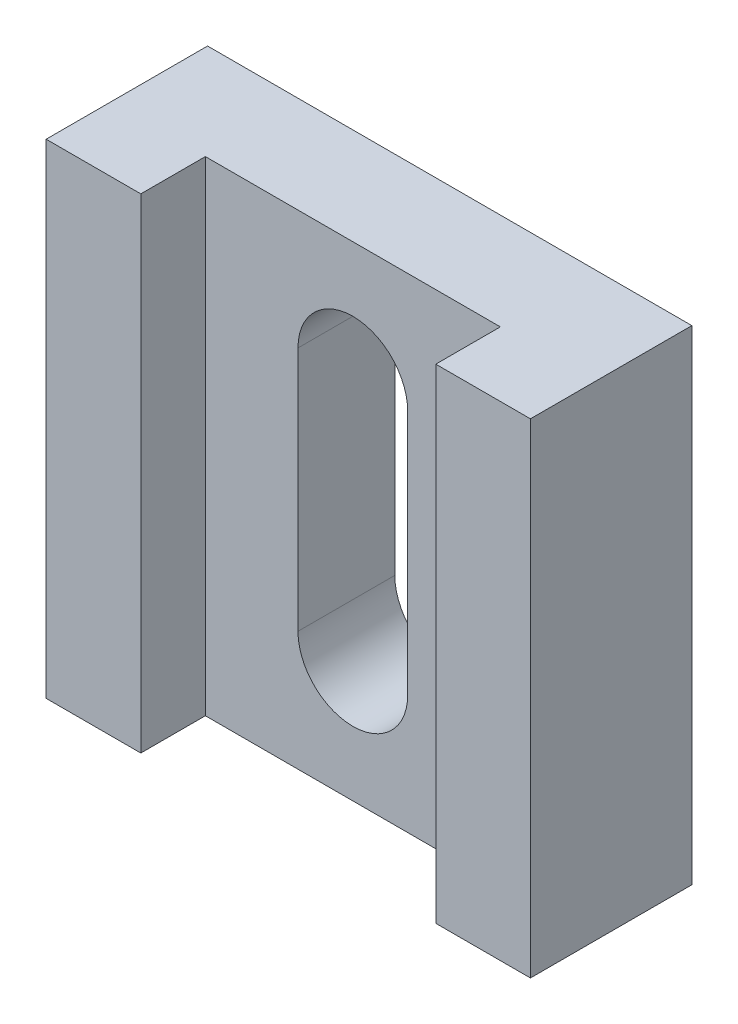
ISO-10303-21;
HEADER;
FILE_DESCRIPTION(('STEP AP214'),'2;1');
FILE_NAME('part.step','',(''),(''),'','','');
FILE_SCHEMA(('AUTOMOTIVE_DESIGN { 1 0 10303 214 1 1 1 1 }'));
ENDSEC;
DATA;
#1=APPLICATION_CONTEXT('core data for automotive mechanical design processes');
#2=APPLICATION_PROTOCOL_DEFINITION('international standard','automotive_design',2000,#1);
#3=PRODUCT_CONTEXT('',#1,'mechanical');
#4=PRODUCT('Part','Part','',(#3));
#5=PRODUCT_RELATED_PRODUCT_CATEGORY('part','',(#4));
#6=PRODUCT_DEFINITION_FORMATION('','',#4);
#7=PRODUCT_DEFINITION_CONTEXT('part definition',#1,'design');
#8=PRODUCT_DEFINITION('design','',#6,#7);
#9=PRODUCT_DEFINITION_SHAPE('','',#8);
#10=(LENGTH_UNIT() NAMED_UNIT(*) SI_UNIT(.MILLI.,.METRE.));
#11=(NAMED_UNIT(*) PLANE_ANGLE_UNIT() SI_UNIT($,.RADIAN.));
#12=(NAMED_UNIT(*) SI_UNIT($,.STERADIAN.) SOLID_ANGLE_UNIT());
#13=UNCERTAINTY_MEASURE_WITH_UNIT(LENGTH_MEASURE(1.E-05),#10,'distance_accuracy_value','');
#14=(GEOMETRIC_REPRESENTATION_CONTEXT(3) GLOBAL_UNCERTAINTY_ASSIGNED_CONTEXT((#13)) GLOBAL_UNIT_ASSIGNED_CONTEXT((#10,
#11,#12)) REPRESENTATION_CONTEXT('',''));
#15=CARTESIAN_POINT('',(0.,0.,0.));
#16=DIRECTION('',(0.,0.,1.));
#17=DIRECTION('',(1.,0.,0.));
#18=AXIS2_PLACEMENT_3D('',#15,#16,#17);
#19=CARTESIAN_POINT('',(0.,0.,5.));
#20=DIRECTION('',(0.,0.,1.));
#21=DIRECTION('',(1.,0.,0.));
#22=AXIS2_PLACEMENT_3D('',#19,#20,#21);
#23=PLANE('',#22);
#24=DIRECTION('',(0.,1.,0.));
#25=VECTOR('',#24,1.);
#26=CARTESIAN_POINT('',(4.56808059733739,7.5,5.));
#27=LINE('',#26,#25);
#28=CARTESIAN_POINT('',(4.56808059733739,-7.5,5.));
#29=VERTEX_POINT('',#28);
#30=CARTESIAN_POINT('',(4.56808059733739,7.5,5.));
#31=VERTEX_POINT('',#30);
#32=EDGE_CURVE('E158',#29,#31,#27,.T.);
#33=ORIENTED_EDGE('',*,*,#32,.F.);
#34=DIRECTION('',(1.,0.,0.));
#35=VECTOR('',#34,1.);
#36=CARTESIAN_POINT('',(-7.5,-7.5,5.));
#37=LINE('',#36,#35);
#38=CARTESIAN_POINT('',(7.5,-7.5,5.));
#39=VERTEX_POINT('',#38);
#40=EDGE_CURVE('E195',#29,#39,#37,.T.);
#41=ORIENTED_EDGE('',*,*,#40,.T.);
#42=DIRECTION('',(0.,1.,0.));
#43=VECTOR('',#42,1.);
#44=CARTESIAN_POINT('',(7.5,7.5,5.));
#45=LINE('',#44,#43);
#46=CARTESIAN_POINT('',(7.5,7.5,5.));
#47=VERTEX_POINT('',#46);
#48=EDGE_CURVE('E185',#39,#47,#45,.T.);
#49=ORIENTED_EDGE('',*,*,#48,.T.);
#50=DIRECTION('',(-1.,0.,0.));
#51=VECTOR('',#50,1.);
#52=CARTESIAN_POINT('',(-7.5,7.5,5.));
#53=LINE('',#52,#51);
#54=EDGE_CURVE('E190',#47,#31,#53,.T.);
#55=ORIENTED_EDGE('',*,*,#54,.T.);
#56=EDGE_LOOP('',(#33,#41,#49,#55));
#57=FACE_BOUND('',#56,.T.);
#58=ADVANCED_FACE('F33',(#57),#23,.T.);
#59=CARTESIAN_POINT('',(7.5,7.5,5.));
#60=DIRECTION('',(-1.,0.,0.));
#61=DIRECTION('',(0.,-1.,0.));
#62=AXIS2_PLACEMENT_3D('',#59,#60,#61);
#63=PLANE('',#62);
#64=DIRECTION('',(0.,1.,0.));
#65=VECTOR('',#64,1.);
#66=CARTESIAN_POINT('',(7.5,7.5,0.));
#67=LINE('',#66,#65);
#68=CARTESIAN_POINT('',(7.5,-7.5,0.));
#69=VERTEX_POINT('',#68);
#70=CARTESIAN_POINT('',(7.5,7.5,0.));
#71=VERTEX_POINT('',#70);
#72=EDGE_CURVE('E177',#69,#71,#67,.T.);
#73=ORIENTED_EDGE('',*,*,#72,.T.);
#74=DIRECTION('',(0.,0.,-1.));
#75=VECTOR('',#74,1.);
#76=CARTESIAN_POINT('',(7.5,7.5,5.));
#77=LINE('',#76,#75);
#78=EDGE_CURVE('E11',#47,#71,#77,.T.);
#79=ORIENTED_EDGE('',*,*,#78,.F.);
#80=ORIENTED_EDGE('',*,*,#48,.F.);
#81=DIRECTION('',(0.,0.,-1.));
#82=VECTOR('',#81,1.);
#83=CARTESIAN_POINT('',(7.5,-7.5,5.));
#84=LINE('',#83,#82);
#85=EDGE_CURVE('E199',#39,#69,#84,.T.);
#86=ORIENTED_EDGE('',*,*,#85,.T.);
#87=EDGE_LOOP('',(#73,#79,#80,#86));
#88=FACE_BOUND('',#87,.T.);
#89=ADVANCED_FACE('F35',(#88),#63,.F.);
#90=CARTESIAN_POINT('',(-7.5,7.5,5.));
#91=DIRECTION('',(0.,-1.,0.));
#92=DIRECTION('',(0.,0.,-1.));
#93=AXIS2_PLACEMENT_3D('',#90,#91,#92);
#94=PLANE('',#93);
#95=DIRECTION('',(-1.,0.,0.));
#96=VECTOR('',#95,1.);
#97=CARTESIAN_POINT('',(-4.56808059733739,7.5,3.));
#98=LINE('',#97,#96);
#99=CARTESIAN_POINT('',(4.56808059733739,7.5,3.));
#100=VERTEX_POINT('',#99);
#101=CARTESIAN_POINT('',(-4.56808059733739,7.5,3.));
#102=VERTEX_POINT('',#101);
#103=EDGE_CURVE('E162',#100,#102,#98,.T.);
#104=ORIENTED_EDGE('',*,*,#103,.F.);
#105=DIRECTION('',(0.,0.,1.));
#106=VECTOR('',#105,1.);
#107=CARTESIAN_POINT('',(4.56808059733739,7.5,3.));
#108=LINE('',#107,#106);
#109=EDGE_CURVE('E172',#100,#31,#108,.T.);
#110=ORIENTED_EDGE('',*,*,#109,.T.);
#111=ORIENTED_EDGE('',*,*,#54,.F.);
#112=ORIENTED_EDGE('',*,*,#78,.T.);
#113=DIRECTION('',(-1.,0.,0.));
#114=VECTOR('',#113,1.);
#115=CARTESIAN_POINT('',(-7.5,7.5,0.));
#116=LINE('',#115,#114);
#117=CARTESIAN_POINT('',(-7.5,7.5,0.));
#118=VERTEX_POINT('',#117);
#119=EDGE_CURVE('E202',#71,#118,#116,.T.);
#120=ORIENTED_EDGE('',*,*,#119,.T.);
#121=DIRECTION('',(0.,0.,-1.));
#122=VECTOR('',#121,1.);
#123=CARTESIAN_POINT('',(-7.5,7.5,5.));
#124=LINE('',#123,#122);
#125=CARTESIAN_POINT('',(-7.5,7.5,5.));
#126=VERTEX_POINT('',#125);
#127=EDGE_CURVE('E41',#126,#118,#124,.T.);
#128=ORIENTED_EDGE('',*,*,#127,.F.);
#129=CARTESIAN_POINT('',(-4.56808059733739,7.5,5.));
#130=VERTEX_POINT('',#129);
#131=EDGE_CURVE('E188',#130,#126,#53,.T.);
#132=ORIENTED_EDGE('',*,*,#131,.F.);
#133=DIRECTION('',(0.,0.,1.));
#134=VECTOR('',#133,1.);
#135=CARTESIAN_POINT('',(-4.56808059733739,7.5,3.));
#136=LINE('',#135,#134);
#137=EDGE_CURVE('E181',#102,#130,#136,.T.);
#138=ORIENTED_EDGE('',*,*,#137,.F.);
#139=EDGE_LOOP('',(#104,#110,#111,#112,#120,#128,#132,#138));
#140=FACE_BOUND('',#139,.T.);
#141=ADVANCED_FACE('F245',(#140),#94,.F.);
#142=CARTESIAN_POINT('',(-7.5,7.5,5.));
#143=DIRECTION('',(1.,0.,0.));
#144=DIRECTION('',(0.,1.,0.));
#145=AXIS2_PLACEMENT_3D('',#142,#143,#144);
#146=PLANE('',#145);
#147=DIRECTION('',(0.,-1.,0.));
#148=VECTOR('',#147,1.);
#149=CARTESIAN_POINT('',(-7.5,7.5,0.));
#150=LINE('',#149,#148);
#151=CARTESIAN_POINT('',(-7.5,-7.5,0.));
#152=VERTEX_POINT('',#151);
#153=EDGE_CURVE('E204',#118,#152,#150,.T.);
#154=ORIENTED_EDGE('',*,*,#153,.T.);
#155=DIRECTION('',(0.,0.,-1.));
#156=VECTOR('',#155,1.);
#157=CARTESIAN_POINT('',(-7.5,-7.5,5.));
#158=LINE('',#157,#156);
#159=CARTESIAN_POINT('',(-7.5,-7.5,5.));
#160=VERTEX_POINT('',#159);
#161=EDGE_CURVE('E209',#160,#152,#158,.T.);
#162=ORIENTED_EDGE('',*,*,#161,.F.);
#163=DIRECTION('',(0.,-1.,0.));
#164=VECTOR('',#163,1.);
#165=CARTESIAN_POINT('',(-7.5,7.5,5.));
#166=LINE('',#165,#164);
#167=EDGE_CURVE('E193',#126,#160,#166,.T.);
#168=ORIENTED_EDGE('',*,*,#167,.F.);
#169=ORIENTED_EDGE('',*,*,#127,.T.);
#170=EDGE_LOOP('',(#154,#162,#168,#169));
#171=FACE_BOUND('',#170,.T.);
#172=ADVANCED_FACE('F216',(#171),#146,.F.);
#173=CARTESIAN_POINT('',(-7.5,-7.5,5.));
#174=DIRECTION('',(0.,1.,0.));
#175=DIRECTION('',(0.,0.,1.));
#176=AXIS2_PLACEMENT_3D('',#173,#174,#175);
#177=PLANE('',#176);
#178=ORIENTED_EDGE('',*,*,#40,.F.);
#179=DIRECTION('',(0.,0.,1.));
#180=VECTOR('',#179,1.);
#181=CARTESIAN_POINT('',(4.56808059733739,-7.5,3.));
#182=LINE('',#181,#180);
#183=CARTESIAN_POINT('',(4.56808059733739,-7.5,3.));
#184=VERTEX_POINT('',#183);
#185=EDGE_CURVE('E175',#184,#29,#182,.T.);
#186=ORIENTED_EDGE('',*,*,#185,.F.);
#187=DIRECTION('',(1.,0.,0.));
#188=VECTOR('',#187,1.);
#189=CARTESIAN_POINT('',(-4.56808059733739,-7.5,3.));
#190=LINE('',#189,#188);
#191=CARTESIAN_POINT('',(-4.56808059733739,-7.5,3.));
#192=VERTEX_POINT('',#191);
#193=EDGE_CURVE('E169',#192,#184,#190,.T.);
#194=ORIENTED_EDGE('',*,*,#193,.F.);
#195=DIRECTION('',(0.,0.,1.));
#196=VECTOR('',#195,1.);
#197=CARTESIAN_POINT('',(-4.56808059733739,-7.5,3.));
#198=LINE('',#197,#196);
#199=CARTESIAN_POINT('',(-4.56808059733739,-7.5,5.));
#200=VERTEX_POINT('',#199);
#201=EDGE_CURVE('E178',#192,#200,#198,.T.);
#202=ORIENTED_EDGE('',*,*,#201,.T.);
#203=EDGE_CURVE('E196',#160,#200,#37,.T.);
#204=ORIENTED_EDGE('',*,*,#203,.F.);
#205=ORIENTED_EDGE('',*,*,#161,.T.);
#206=DIRECTION('',(1.,0.,0.));
#207=VECTOR('',#206,1.);
#208=CARTESIAN_POINT('',(-7.5,-7.5,0.));
#209=LINE('',#208,#207);
#210=EDGE_CURVE('E189',#152,#69,#209,.T.);
#211=ORIENTED_EDGE('',*,*,#210,.T.);
#212=ORIENTED_EDGE('',*,*,#85,.F.);
#213=EDGE_LOOP('',(#178,#186,#194,#202,#204,#205,#211,#212));
#214=FACE_BOUND('',#213,.T.);
#215=ADVANCED_FACE('F227',(#214),#177,.F.);
#216=DIRECTION('',(0.,-1.,0.));
#217=VECTOR('',#216,1.);
#218=CARTESIAN_POINT('',(-4.56808059733739,7.5,5.));
#219=LINE('',#218,#217);
#220=EDGE_CURVE('E163',#130,#200,#219,.T.);
#221=ORIENTED_EDGE('',*,*,#220,.F.);
#222=ORIENTED_EDGE('',*,*,#131,.T.);
#223=ORIENTED_EDGE('',*,*,#167,.T.);
#224=ORIENTED_EDGE('',*,*,#203,.T.);
#225=EDGE_LOOP('',(#221,#222,#223,#224));
#226=FACE_BOUND('',#225,.T.);
#227=ADVANCED_FACE('F244',(#226),#23,.T.);
#228=CARTESIAN_POINT('',(0.,0.,0.));
#229=DIRECTION('',(0.,0.,1.));
#230=DIRECTION('',(1.,0.,0.));
#231=AXIS2_PLACEMENT_3D('',#228,#229,#230);
#232=PLANE('',#231);
#233=DIRECTION('',(0.,-1.,0.));
#234=VECTOR('',#233,1.);
#235=CARTESIAN_POINT('',(1.7,0.,0.));
#236=LINE('',#235,#234);
#237=CARTESIAN_POINT('',(1.7,3.8,0.));
#238=VERTEX_POINT('',#237);
#239=CARTESIAN_POINT('',(1.7,-3.8,0.));
#240=VERTEX_POINT('',#239);
#241=EDGE_CURVE('E153',#238,#240,#236,.T.);
#242=ORIENTED_EDGE('',*,*,#241,.F.);
#243=CARTESIAN_POINT('',(0.,3.8,0.));
#244=DIRECTION('',(0.,0.,1.));
#245=DIRECTION('',(1.,0.,0.));
#246=AXIS2_PLACEMENT_3D('',#243,#244,#245);
#247=CIRCLE('',#246,1.7);
#248=CARTESIAN_POINT('',(-1.7,3.8,0.));
#249=VERTEX_POINT('',#248);
#250=EDGE_CURVE('E155',#238,#249,#247,.T.);
#251=ORIENTED_EDGE('',*,*,#250,.T.);
#252=DIRECTION('',(0.,1.,0.));
#253=VECTOR('',#252,1.);
#254=CARTESIAN_POINT('',(-1.7,0.,0.));
#255=LINE('',#254,#253);
#256=CARTESIAN_POINT('',(-1.7,-3.8,0.));
#257=VERTEX_POINT('',#256);
#258=EDGE_CURVE('E148',#257,#249,#255,.T.);
#259=ORIENTED_EDGE('',*,*,#258,.F.);
#260=CARTESIAN_POINT('',(0.,-3.8,0.));
#261=DIRECTION('',(0.,0.,1.));
#262=DIRECTION('',(1.,0.,0.));
#263=AXIS2_PLACEMENT_3D('',#260,#261,#262);
#264=CIRCLE('',#263,1.7);
#265=EDGE_CURVE('E128',#257,#240,#264,.T.);
#266=ORIENTED_EDGE('',*,*,#265,.T.);
#267=EDGE_LOOP('',(#242,#251,#259,#266));
#268=FACE_BOUND('',#267,.T.);
#269=ORIENTED_EDGE('',*,*,#72,.F.);
#270=ORIENTED_EDGE('',*,*,#210,.F.);
#271=ORIENTED_EDGE('',*,*,#153,.F.);
#272=ORIENTED_EDGE('',*,*,#119,.F.);
#273=EDGE_LOOP('',(#269,#270,#271,#272));
#274=FACE_BOUND('',#273,.T.);
#275=ADVANCED_FACE('F223',(#268,#274),#232,.F.);
#276=CARTESIAN_POINT('',(4.56808059733739,7.5,3.));
#277=DIRECTION('',(1.,0.,0.));
#278=DIRECTION('',(0.,0.,-1.));
#279=AXIS2_PLACEMENT_3D('',#276,#277,#278);
#280=PLANE('',#279);
#281=ORIENTED_EDGE('',*,*,#32,.T.);
#282=ORIENTED_EDGE('',*,*,#109,.F.);
#283=DIRECTION('',(0.,1.,0.));
#284=VECTOR('',#283,1.);
#285=CARTESIAN_POINT('',(4.56808059733739,7.5,3.));
#286=LINE('',#285,#284);
#287=EDGE_CURVE('E159',#184,#100,#286,.T.);
#288=ORIENTED_EDGE('',*,*,#287,.F.);
#289=ORIENTED_EDGE('',*,*,#185,.T.);
#290=EDGE_LOOP('',(#281,#282,#288,#289));
#291=FACE_BOUND('',#290,.T.);
#292=ADVANCED_FACE('F237',(#291),#280,.F.);
#293=CARTESIAN_POINT('',(-4.56808059733739,7.5,3.));
#294=DIRECTION('',(-1.,0.,0.));
#295=DIRECTION('',(0.,0.,1.));
#296=AXIS2_PLACEMENT_3D('',#293,#294,#295);
#297=PLANE('',#296);
#298=ORIENTED_EDGE('',*,*,#220,.T.);
#299=ORIENTED_EDGE('',*,*,#201,.F.);
#300=DIRECTION('',(0.,-1.,0.));
#301=VECTOR('',#300,1.);
#302=CARTESIAN_POINT('',(-4.56808059733739,7.5,3.));
#303=LINE('',#302,#301);
#304=EDGE_CURVE('E166',#102,#192,#303,.T.);
#305=ORIENTED_EDGE('',*,*,#304,.F.);
#306=ORIENTED_EDGE('',*,*,#137,.T.);
#307=EDGE_LOOP('',(#298,#299,#305,#306));
#308=FACE_BOUND('',#307,.T.);
#309=ADVANCED_FACE('F241',(#308),#297,.F.);
#310=CARTESIAN_POINT('',(0.,0.,3.));
#311=DIRECTION('',(0.,0.,1.));
#312=DIRECTION('',(1.,0.,0.));
#313=AXIS2_PLACEMENT_3D('',#310,#311,#312);
#314=PLANE('',#313);
#315=CARTESIAN_POINT('',(0.,3.8,3.));
#316=DIRECTION('',(0.,0.,1.));
#317=DIRECTION('',(1.,0.,0.));
#318=AXIS2_PLACEMENT_3D('',#315,#316,#317);
#319=CIRCLE('',#318,1.7);
#320=CARTESIAN_POINT('',(1.7,3.8,3.));
#321=VERTEX_POINT('',#320);
#322=CARTESIAN_POINT('',(-1.7,3.8,3.));
#323=VERTEX_POINT('',#322);
#324=EDGE_CURVE('E56',#321,#323,#319,.T.);
#325=ORIENTED_EDGE('',*,*,#324,.F.);
#326=DIRECTION('',(0.,-1.,0.));
#327=VECTOR('',#326,1.);
#328=CARTESIAN_POINT('',(1.7,0.,3.));
#329=LINE('',#328,#327);
#330=CARTESIAN_POINT('',(1.7,-3.8,3.));
#331=VERTEX_POINT('',#330);
#332=EDGE_CURVE('E141',#321,#331,#329,.T.);
#333=ORIENTED_EDGE('',*,*,#332,.T.);
#334=CARTESIAN_POINT('',(0.,-3.8,3.));
#335=DIRECTION('',(0.,0.,1.));
#336=DIRECTION('',(1.,0.,0.));
#337=AXIS2_PLACEMENT_3D('',#334,#335,#336);
#338=CIRCLE('',#337,1.7);
#339=CARTESIAN_POINT('',(-1.7,-3.8,3.));
#340=VERTEX_POINT('',#339);
#341=EDGE_CURVE('E125',#340,#331,#338,.T.);
#342=ORIENTED_EDGE('',*,*,#341,.F.);
#343=DIRECTION('',(0.,1.,0.));
#344=VECTOR('',#343,1.);
#345=CARTESIAN_POINT('',(-1.7,0.,3.));
#346=LINE('',#345,#344);
#347=EDGE_CURVE('E134',#340,#323,#346,.T.);
#348=ORIENTED_EDGE('',*,*,#347,.T.);
#349=EDGE_LOOP('',(#325,#333,#342,#348));
#350=FACE_BOUND('',#349,.T.);
#351=ORIENTED_EDGE('',*,*,#287,.T.);
#352=ORIENTED_EDGE('',*,*,#103,.T.);
#353=ORIENTED_EDGE('',*,*,#304,.T.);
#354=ORIENTED_EDGE('',*,*,#193,.T.);
#355=EDGE_LOOP('',(#351,#352,#353,#354));
#356=FACE_BOUND('',#355,.T.);
#357=ADVANCED_FACE('F138',(#350,#356),#314,.T.);
#358=CARTESIAN_POINT('',(0.,3.8,-9.));
#359=DIRECTION('',(0.,0.,1.));
#360=DIRECTION('',(1.,0.,0.));
#361=AXIS2_PLACEMENT_3D('',#358,#359,#360);
#362=CYLINDRICAL_SURFACE('',#361,1.7);
#363=DIRECTION('',(0.,0.,1.));
#364=VECTOR('',#363,1.);
#365=CARTESIAN_POINT('',(1.7,3.8,-9.));
#366=LINE('',#365,#364);
#367=EDGE_CURVE('E146',#238,#321,#366,.T.);
#368=ORIENTED_EDGE('',*,*,#367,.T.);
#369=ORIENTED_EDGE('',*,*,#324,.T.);
#370=DIRECTION('',(0.,0.,1.));
#371=VECTOR('',#370,1.);
#372=CARTESIAN_POINT('',(-1.7,3.8,-9.));
#373=LINE('',#372,#371);
#374=EDGE_CURVE('E131',#249,#323,#373,.T.);
#375=ORIENTED_EDGE('',*,*,#374,.F.);
#376=ORIENTED_EDGE('',*,*,#250,.F.);
#377=EDGE_LOOP('',(#368,#369,#375,#376));
#378=FACE_BOUND('',#377,.T.);
#379=ADVANCED_FACE('F312',(#378),#362,.F.);
#380=CARTESIAN_POINT('',(1.7,0.,-9.));
#381=DIRECTION('',(-1.,0.,0.));
#382=DIRECTION('',(0.,0.,1.));
#383=AXIS2_PLACEMENT_3D('',#380,#381,#382);
#384=PLANE('',#383);
#385=ORIENTED_EDGE('',*,*,#241,.T.);
#386=DIRECTION('',(0.,0.,1.));
#387=VECTOR('',#386,1.);
#388=CARTESIAN_POINT('',(1.7,-3.8,-9.));
#389=LINE('',#388,#387);
#390=EDGE_CURVE('E130',#240,#331,#389,.T.);
#391=ORIENTED_EDGE('',*,*,#390,.T.);
#392=ORIENTED_EDGE('',*,*,#332,.F.);
#393=ORIENTED_EDGE('',*,*,#367,.F.);
#394=EDGE_LOOP('',(#385,#391,#392,#393));
#395=FACE_BOUND('',#394,.T.);
#396=ADVANCED_FACE('F320',(#395),#384,.T.);
#397=CARTESIAN_POINT('',(0.,-3.8,-9.));
#398=DIRECTION('',(0.,0.,1.));
#399=DIRECTION('',(1.,0.,0.));
#400=AXIS2_PLACEMENT_3D('',#397,#398,#399);
#401=CYLINDRICAL_SURFACE('',#400,1.7);
#402=DIRECTION('',(0.,0.,1.));
#403=VECTOR('',#402,1.);
#404=CARTESIAN_POINT('',(-1.7,-3.8,-9.));
#405=LINE('',#404,#403);
#406=EDGE_CURVE('E48',#257,#340,#405,.T.);
#407=ORIENTED_EDGE('',*,*,#406,.T.);
#408=ORIENTED_EDGE('',*,*,#341,.T.);
#409=ORIENTED_EDGE('',*,*,#390,.F.);
#410=ORIENTED_EDGE('',*,*,#265,.F.);
#411=EDGE_LOOP('',(#407,#408,#409,#410));
#412=FACE_BOUND('',#411,.T.);
#413=ADVANCED_FACE('F122',(#412),#401,.F.);
#414=CARTESIAN_POINT('',(-1.7,0.,-9.));
#415=DIRECTION('',(1.,0.,0.));
#416=DIRECTION('',(0.,0.,-1.));
#417=AXIS2_PLACEMENT_3D('',#414,#415,#416);
#418=PLANE('',#417);
#419=ORIENTED_EDGE('',*,*,#258,.T.);
#420=ORIENTED_EDGE('',*,*,#374,.T.);
#421=ORIENTED_EDGE('',*,*,#347,.F.);
#422=ORIENTED_EDGE('',*,*,#406,.F.);
#423=EDGE_LOOP('',(#419,#420,#421,#422));
#424=FACE_BOUND('',#423,.T.);
#425=ADVANCED_FACE('F135',(#424),#418,.T.);
#426=CLOSED_SHELL('',(#58,#89,#141,#172,#215,#227,#275,#292,#309,#357,#379,#396,#413,#425));
#427=MANIFOLD_SOLID_BREP('B2',#426);
#428=ADVANCED_BREP_SHAPE_REPRESENTATION('',(#18,#427),#14);
#429=SHAPE_DEFINITION_REPRESENTATION(#9,#428);
ENDSEC;
END-ISO-10303-21;
